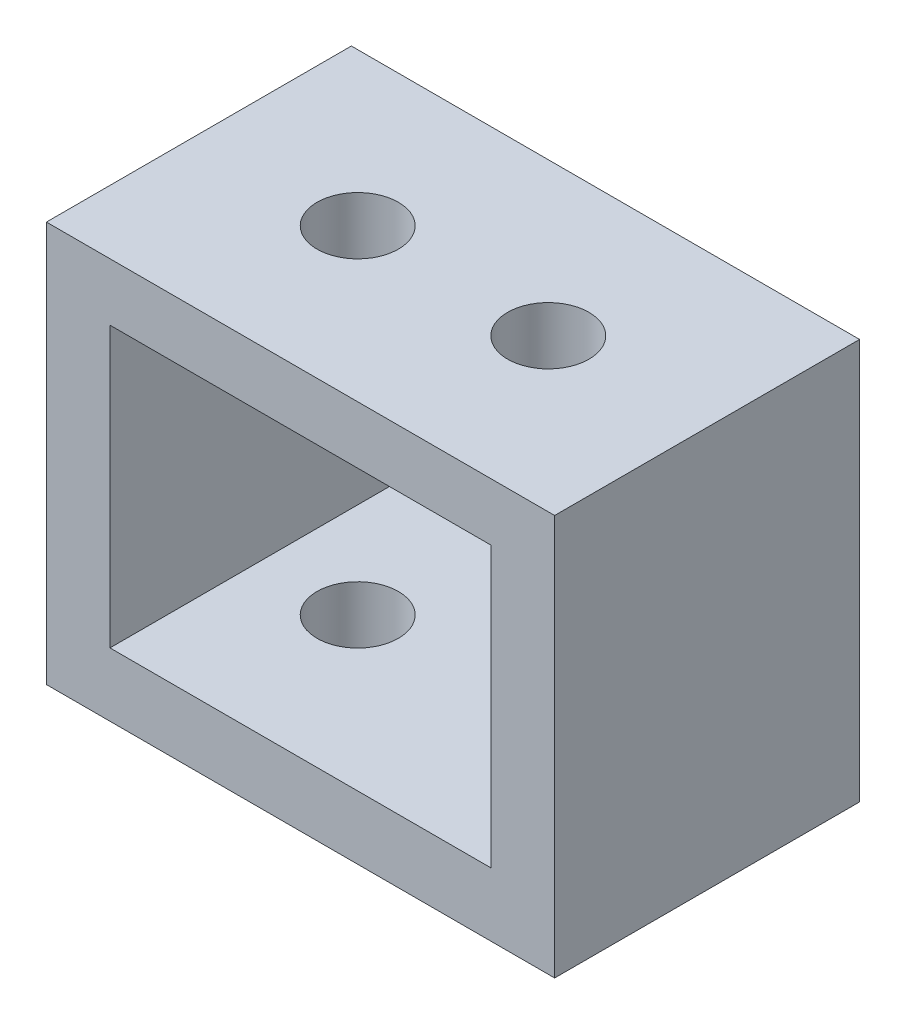
ISO-10303-21;
HEADER;
FILE_DESCRIPTION(('STEP AP214'),'2;1');
FILE_NAME('part.step','',(''),(''),'','','');
FILE_SCHEMA(('AUTOMOTIVE_DESIGN { 1 0 10303 214 1 1 1 1 }'));
ENDSEC;
DATA;
#1=APPLICATION_CONTEXT('core data for automotive mechanical design processes');
#2=APPLICATION_PROTOCOL_DEFINITION('international standard','automotive_design',2000,#1);
#3=PRODUCT_CONTEXT('',#1,'mechanical');
#4=PRODUCT('Part','Part','',(#3));
#5=PRODUCT_RELATED_PRODUCT_CATEGORY('part','',(#4));
#6=PRODUCT_DEFINITION_FORMATION('','',#4);
#7=PRODUCT_DEFINITION_CONTEXT('part definition',#1,'design');
#8=PRODUCT_DEFINITION('design','',#6,#7);
#9=PRODUCT_DEFINITION_SHAPE('','',#8);
#10=(LENGTH_UNIT() NAMED_UNIT(*) SI_UNIT(.MILLI.,.METRE.));
#11=(NAMED_UNIT(*) PLANE_ANGLE_UNIT() SI_UNIT($,.RADIAN.));
#12=(NAMED_UNIT(*) SI_UNIT($,.STERADIAN.) SOLID_ANGLE_UNIT());
#13=UNCERTAINTY_MEASURE_WITH_UNIT(LENGTH_MEASURE(1.E-05),#10,'distance_accuracy_value','');
#14=(GEOMETRIC_REPRESENTATION_CONTEXT(3) GLOBAL_UNCERTAINTY_ASSIGNED_CONTEXT((#13)) GLOBAL_UNIT_ASSIGNED_CONTEXT((#10,
#11,#12)) REPRESENTATION_CONTEXT('',''));
#15=CARTESIAN_POINT('',(0.,0.,0.));
#16=DIRECTION('',(0.,0.,1.));
#17=DIRECTION('',(1.,0.,0.));
#18=AXIS2_PLACEMENT_3D('',#15,#16,#17);
#19=CARTESIAN_POINT('',(0.,5.,-12.));
#20=DIRECTION('',(0.,0.,-1.));
#21=DIRECTION('',(-1.,0.,0.));
#22=AXIS2_PLACEMENT_3D('',#19,#20,#21);
#23=PLANE('',#22);
#24=DIRECTION('',(1.,0.,0.));
#25=VECTOR('',#24,1.);
#26=CARTESIAN_POINT('',(-20.,4.5268084003717,-12.));
#27=LINE('',#26,#25);
#28=CARTESIAN_POINT('',(-20.,4.52680840037171,-12.));
#29=VERTEX_POINT('',#28);
#30=CARTESIAN_POINT('',(20.,4.5268084003717,-12.));
#31=VERTEX_POINT('',#30);
#32=EDGE_CURVE('E55',#29,#31,#27,.T.);
#33=ORIENTED_EDGE('',*,*,#32,.T.);
#34=DIRECTION('',(0.,1.,0.));
#35=VECTOR('',#34,1.);
#36=CARTESIAN_POINT('',(20.,30.,-12.));
#37=LINE('',#36,#35);
#38=CARTESIAN_POINT('',(20.,-27.,-12.));
#39=VERTEX_POINT('',#38);
#40=EDGE_CURVE('E167',#39,#31,#37,.T.);
#41=ORIENTED_EDGE('',*,*,#40,.F.);
#42=DIRECTION('',(-1.,0.,0.));
#43=VECTOR('',#42,1.);
#44=CARTESIAN_POINT('',(20.,-27.,-12.));
#45=LINE('',#44,#43);
#46=CARTESIAN_POINT('',(-20.,-27.,-12.));
#47=VERTEX_POINT('',#46);
#48=EDGE_CURVE('E170',#39,#47,#45,.T.);
#49=ORIENTED_EDGE('',*,*,#48,.T.);
#50=DIRECTION('',(0.,1.,0.));
#51=VECTOR('',#50,1.);
#52=CARTESIAN_POINT('',(-20.,30.,-12.));
#53=LINE('',#52,#51);
#54=EDGE_CURVE('E127',#47,#29,#53,.T.);
#55=ORIENTED_EDGE('',*,*,#54,.T.);
#56=EDGE_LOOP('',(#33,#41,#49,#55));
#57=FACE_BOUND('',#56,.T.);
#58=DIRECTION('',(0.,1.,0.));
#59=VECTOR('',#58,1.);
#60=CARTESIAN_POINT('',(15.,30.,-12.));
#61=LINE('',#60,#59);
#62=CARTESIAN_POINT('',(15.,-22.,-12.));
#63=VERTEX_POINT('',#62);
#64=CARTESIAN_POINT('',(15.,0.,-12.));
#65=VERTEX_POINT('',#64);
#66=EDGE_CURVE('E165',#63,#65,#61,.T.);
#67=ORIENTED_EDGE('',*,*,#66,.T.);
#68=DIRECTION('',(1.,0.,0.));
#69=VECTOR('',#68,1.);
#70=CARTESIAN_POINT('',(0.,0.,-12.));
#71=LINE('',#70,#69);
#72=CARTESIAN_POINT('',(-15.,0.,-12.));
#73=VERTEX_POINT('',#72);
#74=EDGE_CURVE('E47',#73,#65,#71,.T.);
#75=ORIENTED_EDGE('',*,*,#74,.F.);
#76=DIRECTION('',(0.,1.,0.));
#77=VECTOR('',#76,1.);
#78=CARTESIAN_POINT('',(-15.,30.,-12.));
#79=LINE('',#78,#77);
#80=CARTESIAN_POINT('',(-15.,-22.,-12.));
#81=VERTEX_POINT('',#80);
#82=EDGE_CURVE('E125',#81,#73,#79,.T.);
#83=ORIENTED_EDGE('',*,*,#82,.F.);
#84=DIRECTION('',(-1.,0.,0.));
#85=VECTOR('',#84,1.);
#86=CARTESIAN_POINT('',(-15.,-22.,-12.));
#87=LINE('',#86,#85);
#88=EDGE_CURVE('E157',#63,#81,#87,.T.);
#89=ORIENTED_EDGE('',*,*,#88,.F.);
#90=EDGE_LOOP('',(#67,#75,#83,#89));
#91=FACE_BOUND('',#90,.T.);
#92=ADVANCED_FACE('F39',(#57,#91),#23,.T.);
#93=CARTESIAN_POINT('',(0.,5.,12.));
#94=DIRECTION('',(0.,0.,-1.));
#95=DIRECTION('',(-1.,0.,0.));
#96=AXIS2_PLACEMENT_3D('',#93,#94,#95);
#97=PLANE('',#96);
#98=DIRECTION('',(0.,-1.,0.));
#99=VECTOR('',#98,1.);
#100=CARTESIAN_POINT('',(-15.,30.,12.));
#101=LINE('',#100,#99);
#102=CARTESIAN_POINT('',(-15.,0.,12.));
#103=VERTEX_POINT('',#102);
#104=CARTESIAN_POINT('',(-15.,-22.,12.));
#105=VERTEX_POINT('',#104);
#106=EDGE_CURVE('E130',#103,#105,#101,.T.);
#107=ORIENTED_EDGE('',*,*,#106,.F.);
#108=DIRECTION('',(1.,0.,0.));
#109=VECTOR('',#108,1.);
#110=CARTESIAN_POINT('',(0.,0.,12.));
#111=LINE('',#110,#109);
#112=CARTESIAN_POINT('',(15.,0.,12.));
#113=VERTEX_POINT('',#112);
#114=EDGE_CURVE('E11',#103,#113,#111,.T.);
#115=ORIENTED_EDGE('',*,*,#114,.T.);
#116=DIRECTION('',(0.,-1.,0.));
#117=VECTOR('',#116,1.);
#118=CARTESIAN_POINT('',(15.,30.,12.));
#119=LINE('',#118,#117);
#120=CARTESIAN_POINT('',(15.,-22.,12.));
#121=VERTEX_POINT('',#120);
#122=EDGE_CURVE('E162',#113,#121,#119,.T.);
#123=ORIENTED_EDGE('',*,*,#122,.T.);
#124=DIRECTION('',(1.,0.,0.));
#125=VECTOR('',#124,1.);
#126=CARTESIAN_POINT('',(-15.,-22.,12.));
#127=LINE('',#126,#125);
#128=EDGE_CURVE('E160',#105,#121,#127,.T.);
#129=ORIENTED_EDGE('',*,*,#128,.F.);
#130=EDGE_LOOP('',(#107,#115,#123,#129));
#131=FACE_BOUND('',#130,.T.);
#132=DIRECTION('',(0.,-1.,0.));
#133=VECTOR('',#132,1.);
#134=CARTESIAN_POINT('',(20.,30.,12.));
#135=LINE('',#134,#133);
#136=CARTESIAN_POINT('',(20.,4.5268084003717,12.));
#137=VERTEX_POINT('',#136);
#138=CARTESIAN_POINT('',(20.,-27.,12.));
#139=VERTEX_POINT('',#138);
#140=EDGE_CURVE('E119',#137,#139,#135,.T.);
#141=ORIENTED_EDGE('',*,*,#140,.F.);
#142=DIRECTION('',(1.,0.,0.));
#143=VECTOR('',#142,1.);
#144=CARTESIAN_POINT('',(-20.,4.5268084003717,12.));
#145=LINE('',#144,#143);
#146=CARTESIAN_POINT('',(-20.,4.5268084003717,12.));
#147=VERTEX_POINT('',#146);
#148=EDGE_CURVE('E105',#147,#137,#145,.T.);
#149=ORIENTED_EDGE('',*,*,#148,.F.);
#150=DIRECTION('',(0.,-1.,0.));
#151=VECTOR('',#150,1.);
#152=CARTESIAN_POINT('',(-20.,30.,12.));
#153=LINE('',#152,#151);
#154=CARTESIAN_POINT('',(-20.,-27.,12.));
#155=VERTEX_POINT('',#154);
#156=EDGE_CURVE('E117',#147,#155,#153,.T.);
#157=ORIENTED_EDGE('',*,*,#156,.T.);
#158=DIRECTION('',(-1.,0.,0.));
#159=VECTOR('',#158,1.);
#160=CARTESIAN_POINT('',(20.,-27.,12.));
#161=LINE('',#160,#159);
#162=EDGE_CURVE('E174',#139,#155,#161,.T.);
#163=ORIENTED_EDGE('',*,*,#162,.F.);
#164=EDGE_LOOP('',(#141,#149,#157,#163));
#165=FACE_BOUND('',#164,.T.);
#166=ADVANCED_FACE('F115',(#131,#165),#97,.F.);
#167=CARTESIAN_POINT('',(0.,0.,0.));
#168=DIRECTION('',(0.,1.,0.));
#169=DIRECTION('',(0.,0.,1.));
#170=AXIS2_PLACEMENT_3D('',#167,#168,#169);
#171=PLANE('',#170);
#172=CARTESIAN_POINT('',(7.5,0.,0.));
#173=DIRECTION('',(0.,1.,0.));
#174=DIRECTION('',(0.,0.,1.));
#175=AXIS2_PLACEMENT_3D('',#172,#173,#174);
#176=CIRCLE('',#175,3.2);
#177=CARTESIAN_POINT('',(7.5,0.,-3.2));
#178=VERTEX_POINT('',#177);
#179=EDGE_CURVE('E144',#178,#178,#176,.T.);
#180=ORIENTED_EDGE('',*,*,#179,.T.);
#181=EDGE_LOOP('',(#180));
#182=FACE_BOUND('',#181,.T.);
#183=CARTESIAN_POINT('',(-7.5,0.,0.));
#184=DIRECTION('',(0.,1.,0.));
#185=DIRECTION('',(0.,0.,1.));
#186=AXIS2_PLACEMENT_3D('',#183,#184,#185);
#187=CIRCLE('',#186,3.2);
#188=CARTESIAN_POINT('',(-7.5,0.,-3.2));
#189=VERTEX_POINT('',#188);
#190=EDGE_CURVE('E151',#189,#189,#187,.T.);
#191=ORIENTED_EDGE('',*,*,#190,.T.);
#192=EDGE_LOOP('',(#191));
#193=FACE_BOUND('',#192,.T.);
#194=DIRECTION('',(0.,0.,1.));
#195=VECTOR('',#194,1.);
#196=CARTESIAN_POINT('',(15.,0.,0.));
#197=LINE('',#196,#195);
#198=EDGE_CURVE('E176',#65,#113,#197,.T.);
#199=ORIENTED_EDGE('',*,*,#198,.T.);
#200=ORIENTED_EDGE('',*,*,#114,.F.);
#201=DIRECTION('',(0.,0.,1.));
#202=VECTOR('',#201,1.);
#203=CARTESIAN_POINT('',(-15.,0.,0.));
#204=LINE('',#203,#202);
#205=EDGE_CURVE('E137',#73,#103,#204,.T.);
#206=ORIENTED_EDGE('',*,*,#205,.F.);
#207=ORIENTED_EDGE('',*,*,#74,.T.);
#208=EDGE_LOOP('',(#199,#200,#206,#207));
#209=FACE_BOUND('',#208,.T.);
#210=ADVANCED_FACE('F202',(#182,#193,#209),#171,.F.);
#211=CARTESIAN_POINT('',(20.,-27.,12.));
#212=DIRECTION('',(0.,1.,0.));
#213=DIRECTION('',(0.,0.,1.));
#214=AXIS2_PLACEMENT_3D('',#211,#212,#213);
#215=PLANE('',#214);
#216=CARTESIAN_POINT('',(7.5,-27.,0.));
#217=DIRECTION('',(0.,-1.,0.));
#218=DIRECTION('',(0.,0.,-1.));
#219=AXIS2_PLACEMENT_3D('',#216,#217,#218);
#220=CIRCLE('',#219,3.2);
#221=CARTESIAN_POINT('',(7.5,-27.,-3.2));
#222=VERTEX_POINT('',#221);
#223=EDGE_CURVE('E141',#222,#222,#220,.T.);
#224=ORIENTED_EDGE('',*,*,#223,.F.);
#225=EDGE_LOOP('',(#224));
#226=FACE_BOUND('',#225,.T.);
#227=CARTESIAN_POINT('',(-7.5,-27.,0.));
#228=DIRECTION('',(0.,-1.,0.));
#229=DIRECTION('',(0.,0.,-1.));
#230=AXIS2_PLACEMENT_3D('',#227,#228,#229);
#231=CIRCLE('',#230,3.2);
#232=CARTESIAN_POINT('',(-7.5,-27.,-3.2));
#233=VERTEX_POINT('',#232);
#234=EDGE_CURVE('E147',#233,#233,#231,.T.);
#235=ORIENTED_EDGE('',*,*,#234,.F.);
#236=EDGE_LOOP('',(#235));
#237=FACE_BOUND('',#236,.T.);
#238=DIRECTION('',(0.,0.,-1.));
#239=VECTOR('',#238,1.);
#240=CARTESIAN_POINT('',(-20.,-27.,12.));
#241=LINE('',#240,#239);
#242=EDGE_CURVE('E124',#155,#47,#241,.T.);
#243=ORIENTED_EDGE('',*,*,#242,.T.);
#244=ORIENTED_EDGE('',*,*,#48,.F.);
#245=DIRECTION('',(0.,0.,-1.));
#246=VECTOR('',#245,1.);
#247=CARTESIAN_POINT('',(20.,-27.,12.));
#248=LINE('',#247,#246);
#249=EDGE_CURVE('E164',#139,#39,#248,.T.);
#250=ORIENTED_EDGE('',*,*,#249,.F.);
#251=ORIENTED_EDGE('',*,*,#162,.T.);
#252=EDGE_LOOP('',(#243,#244,#250,#251));
#253=FACE_BOUND('',#252,.T.);
#254=ADVANCED_FACE('F211',(#226,#237,#253),#215,.F.);
#255=CARTESIAN_POINT('',(20.,0.,0.));
#256=DIRECTION('',(1.,0.,0.));
#257=DIRECTION('',(0.,0.,-1.));
#258=AXIS2_PLACEMENT_3D('',#255,#256,#257);
#259=PLANE('',#258);
#260=DIRECTION('',(0.,0.,1.));
#261=VECTOR('',#260,1.);
#262=CARTESIAN_POINT('',(20.,4.5268084003717,-12.));
#263=LINE('',#262,#261);
#264=EDGE_CURVE('E111',#31,#137,#263,.T.);
#265=ORIENTED_EDGE('',*,*,#264,.T.);
#266=ORIENTED_EDGE('',*,*,#140,.T.);
#267=ORIENTED_EDGE('',*,*,#249,.T.);
#268=ORIENTED_EDGE('',*,*,#40,.T.);
#269=EDGE_LOOP('',(#265,#266,#267,#268));
#270=FACE_BOUND('',#269,.T.);
#271=ADVANCED_FACE('F218',(#270),#259,.T.);
#272=CARTESIAN_POINT('',(15.,0.,0.));
#273=DIRECTION('',(1.,0.,0.));
#274=DIRECTION('',(0.,0.,-1.));
#275=AXIS2_PLACEMENT_3D('',#272,#273,#274);
#276=PLANE('',#275);
#277=ORIENTED_EDGE('',*,*,#66,.F.);
#278=DIRECTION('',(0.,0.,-1.));
#279=VECTOR('',#278,1.);
#280=CARTESIAN_POINT('',(15.,-22.,-12.));
#281=LINE('',#280,#279);
#282=EDGE_CURVE('E154',#121,#63,#281,.T.);
#283=ORIENTED_EDGE('',*,*,#282,.F.);
#284=ORIENTED_EDGE('',*,*,#122,.F.);
#285=ORIENTED_EDGE('',*,*,#198,.F.);
#286=EDGE_LOOP('',(#277,#283,#284,#285));
#287=FACE_BOUND('',#286,.T.);
#288=ADVANCED_FACE('F188',(#287),#276,.F.);
#289=CARTESIAN_POINT('',(0.,-22.,0.));
#290=DIRECTION('',(0.,1.,0.));
#291=DIRECTION('',(0.,0.,1.));
#292=AXIS2_PLACEMENT_3D('',#289,#290,#291);
#293=PLANE('',#292);
#294=CARTESIAN_POINT('',(7.5,-22.,0.));
#295=DIRECTION('',(0.,1.,0.));
#296=DIRECTION('',(0.,0.,1.));
#297=AXIS2_PLACEMENT_3D('',#294,#295,#296);
#298=CIRCLE('',#297,3.2);
#299=CARTESIAN_POINT('',(7.5,-22.,-3.2));
#300=VERTEX_POINT('',#299);
#301=EDGE_CURVE('E42',#300,#300,#298,.T.);
#302=ORIENTED_EDGE('',*,*,#301,.F.);
#303=EDGE_LOOP('',(#302));
#304=FACE_BOUND('',#303,.T.);
#305=CARTESIAN_POINT('',(-7.5,-22.,0.));
#306=DIRECTION('',(0.,1.,0.));
#307=DIRECTION('',(0.,0.,1.));
#308=AXIS2_PLACEMENT_3D('',#305,#306,#307);
#309=CIRCLE('',#308,3.2);
#310=CARTESIAN_POINT('',(-7.5,-22.,-3.2));
#311=VERTEX_POINT('',#310);
#312=EDGE_CURVE('E150',#311,#311,#309,.T.);
#313=ORIENTED_EDGE('',*,*,#312,.F.);
#314=EDGE_LOOP('',(#313));
#315=FACE_BOUND('',#314,.T.);
#316=ORIENTED_EDGE('',*,*,#282,.T.);
#317=ORIENTED_EDGE('',*,*,#88,.T.);
#318=DIRECTION('',(0.,0.,-1.));
#319=VECTOR('',#318,1.);
#320=CARTESIAN_POINT('',(-15.,-22.,-12.));
#321=LINE('',#320,#319);
#322=EDGE_CURVE('E133',#105,#81,#321,.T.);
#323=ORIENTED_EDGE('',*,*,#322,.F.);
#324=ORIENTED_EDGE('',*,*,#128,.T.);
#325=EDGE_LOOP('',(#316,#317,#323,#324));
#326=FACE_BOUND('',#325,.T.);
#327=ADVANCED_FACE('F185',(#304,#315,#326),#293,.T.);
#328=CARTESIAN_POINT('',(-7.5,30.,0.));
#329=DIRECTION('',(0.,-1.,0.));
#330=DIRECTION('',(0.,0.,-1.));
#331=AXIS2_PLACEMENT_3D('',#328,#329,#330);
#332=CYLINDRICAL_SURFACE('',#331,3.2);
#333=CARTESIAN_POINT('',(-7.5,-22.,-3.2));
#334=CARTESIAN_POINT('',(-7.5,-22.0520833333333,-3.2));
#335=CARTESIAN_POINT('',(-7.5,-22.1041666666667,-3.2));
#336=CARTESIAN_POINT('',(-7.5,-22.2083333333333,-3.2));
#337=CARTESIAN_POINT('',(-7.5,-22.2604166666667,-3.2));
#338=CARTESIAN_POINT('',(-7.5,-22.3645833333333,-3.2));
#339=CARTESIAN_POINT('',(-7.5,-22.4166666666667,-3.2));
#340=CARTESIAN_POINT('',(-7.5,-22.5208333333333,-3.2));
#341=CARTESIAN_POINT('',(-7.5,-22.5729166666667,-3.2));
#342=CARTESIAN_POINT('',(-7.5,-22.6770833333333,-3.2));
#343=CARTESIAN_POINT('',(-7.5,-22.7291666666667,-3.2));
#344=CARTESIAN_POINT('',(-7.5,-22.8333333333333,-3.2));
#345=CARTESIAN_POINT('',(-7.5,-22.8854166666667,-3.2));
#346=CARTESIAN_POINT('',(-7.5,-22.9895833333333,-3.2));
#347=CARTESIAN_POINT('',(-7.5,-23.0416666666667,-3.2));
#348=CARTESIAN_POINT('',(-7.5,-23.1458333333333,-3.2));
#349=CARTESIAN_POINT('',(-7.5,-23.1979166666667,-3.2));
#350=CARTESIAN_POINT('',(-7.5,-23.3020833333333,-3.2));
#351=CARTESIAN_POINT('',(-7.5,-23.3541666666667,-3.2));
#352=CARTESIAN_POINT('',(-7.5,-23.4583333333333,-3.2));
#353=CARTESIAN_POINT('',(-7.5,-23.5104166666667,-3.2));
#354=CARTESIAN_POINT('',(-7.5,-23.6145833333333,-3.2));
#355=CARTESIAN_POINT('',(-7.5,-23.6666666666667,-3.2));
#356=CARTESIAN_POINT('',(-7.5,-23.7708333333333,-3.2));
#357=CARTESIAN_POINT('',(-7.5,-23.8229166666667,-3.2));
#358=CARTESIAN_POINT('',(-7.5,-23.9270833333333,-3.2));
#359=CARTESIAN_POINT('',(-7.5,-23.9791666666667,-3.2));
#360=CARTESIAN_POINT('',(-7.5,-24.0833333333333,-3.2));
#361=CARTESIAN_POINT('',(-7.5,-24.1354166666667,-3.2));
#362=CARTESIAN_POINT('',(-7.5,-24.2395833333333,-3.2));
#363=CARTESIAN_POINT('',(-7.5,-24.2916666666667,-3.2));
#364=CARTESIAN_POINT('',(-7.5,-24.3958333333333,-3.2));
#365=CARTESIAN_POINT('',(-7.5,-24.4479166666667,-3.2));
#366=CARTESIAN_POINT('',(-7.5,-24.5520833333333,-3.2));
#367=CARTESIAN_POINT('',(-7.5,-24.6041666666667,-3.2));
#368=CARTESIAN_POINT('',(-7.5,-24.7083333333333,-3.2));
#369=CARTESIAN_POINT('',(-7.5,-24.7604166666667,-3.2));
#370=CARTESIAN_POINT('',(-7.5,-24.8645833333333,-3.2));
#371=CARTESIAN_POINT('',(-7.5,-24.9166666666667,-3.2));
#372=CARTESIAN_POINT('',(-7.5,-25.0208333333333,-3.2));
#373=CARTESIAN_POINT('',(-7.5,-25.0729166666667,-3.2));
#374=CARTESIAN_POINT('',(-7.5,-25.1770833333333,-3.2));
#375=CARTESIAN_POINT('',(-7.5,-25.2291666666667,-3.2));
#376=CARTESIAN_POINT('',(-7.5,-25.3333333333333,-3.2));
#377=CARTESIAN_POINT('',(-7.5,-25.3854166666667,-3.2));
#378=CARTESIAN_POINT('',(-7.5,-25.4895833333333,-3.2));
#379=CARTESIAN_POINT('',(-7.5,-25.5416666666667,-3.2));
#380=CARTESIAN_POINT('',(-7.5,-25.6458333333333,-3.2));
#381=CARTESIAN_POINT('',(-7.5,-25.6979166666667,-3.2));
#382=CARTESIAN_POINT('',(-7.5,-25.8020833333333,-3.2));
#383=CARTESIAN_POINT('',(-7.5,-25.8541666666667,-3.2));
#384=CARTESIAN_POINT('',(-7.5,-25.9583333333333,-3.2));
#385=CARTESIAN_POINT('',(-7.5,-26.0104166666667,-3.2));
#386=CARTESIAN_POINT('',(-7.5,-26.1145833333333,-3.2));
#387=CARTESIAN_POINT('',(-7.5,-26.1666666666667,-3.2));
#388=CARTESIAN_POINT('',(-7.5,-26.2708333333333,-3.2));
#389=CARTESIAN_POINT('',(-7.5,-26.3229166666667,-3.2));
#390=CARTESIAN_POINT('',(-7.5,-26.4270833333333,-3.2));
#391=CARTESIAN_POINT('',(-7.5,-26.4791666666667,-3.2));
#392=CARTESIAN_POINT('',(-7.5,-26.5833333333333,-3.2));
#393=CARTESIAN_POINT('',(-7.5,-26.6354166666667,-3.2));
#394=CARTESIAN_POINT('',(-7.5,-26.7395833333333,-3.2));
#395=CARTESIAN_POINT('',(-7.5,-26.7916666666667,-3.2));
#396=CARTESIAN_POINT('',(-7.5,-26.8958333333333,-3.2));
#397=CARTESIAN_POINT('',(-7.5,-26.9479166666667,-3.2));
#398=CARTESIAN_POINT('',(-7.5,-27.,-3.2));
#399=B_SPLINE_CURVE_WITH_KNOTS('',3,(#333,#334,#335,#336,#337,#338,#339,#340,#341,#342,#343,
#344,#345,#346,#347,#348,#349,#350,#351,#352,#353,#354,#355,#356,#357,#358,#359,#360,#361,#362,
#363,#364,#365,#366,#367,#368,#369,#370,#371,#372,#373,#374,#375,#376,#377,#378,#379,#380,#381,
#382,#383,#384,#385,#386,#387,#388,#389,#390,#391,#392,#393,#394,#395,#396,#397,#398),
.UNSPECIFIED.,.F.,.F.,(4,2,2,2,2,2,2,2,2,2,2,2,2,2,2,2,2,2,2,2,2,2,2,2,2,2,2,2,2,2,2,2,4),(0.,
0.156249999999997,0.3125,0.468749999999997,0.625000000000001,0.781249999999997,
0.937500000000001,1.09375,1.25,1.40625,1.56249999999999,1.71875,1.87499999999999,2.03125,2.1875,
2.34375,2.5,2.65624999999999,2.8125,2.96874999999999,3.125,3.28124999999999,3.4375,
3.59374999999999,3.74999999999999,3.90624999999999,4.06249999999999,4.21874999999999,
4.37499999999999,4.53124999999999,4.68749999999999,4.84374999999999,4.99999999999999),.UNSPECIFIED.);
#400=EDGE_CURVE('BSEAM182',#311,#233,#399,.T.);
#401=ORIENTED_EDGE('',*,*,#312,.T.);
#402=ORIENTED_EDGE('',*,*,#234,.T.);
#403=ORIENTED_EDGE('',*,*,#400,.T.);
#404=ORIENTED_EDGE('',*,*,#400,.F.);
#405=EDGE_LOOP('',(#401,#403,#402,#404));
#406=FACE_BOUND('',#405,.T.);
#407=ADVANCED_FACE('F182',(#406),#332,.F.);
#408=CARTESIAN_POINT('',(-7.5,4.5268084003717,0.));
#409=DIRECTION('',(0.,-1.,0.));
#410=DIRECTION('',(0.,0.,-1.));
#411=AXIS2_PLACEMENT_3D('',#408,#409,#410);
#412=CIRCLE('',#411,3.2);
#413=CARTESIAN_POINT('',(-7.5,4.5268084003717,-3.2));
#414=VERTEX_POINT('',#413);
#415=EDGE_CURVE('E244',#414,#414,#412,.F.);
#416=CARTESIAN_POINT('',(-7.5,4.5268084003717,-3.2));
#417=CARTESIAN_POINT('',(-7.5,4.47965414620116,-3.2));
#418=CARTESIAN_POINT('',(-7.5,4.43249989203063,-3.2));
#419=CARTESIAN_POINT('',(-7.5,4.33819138368955,-3.2));
#420=CARTESIAN_POINT('',(-7.5,4.29103712951901,-3.2));
#421=CARTESIAN_POINT('',(-7.5,4.19672862117793,-3.2));
#422=CARTESIAN_POINT('',(-7.5,4.14957436700739,-3.2));
#423=CARTESIAN_POINT('',(-7.5,4.05526585866632,-3.2));
#424=CARTESIAN_POINT('',(-7.5,4.00811160449578,-3.2));
#425=CARTESIAN_POINT('',(-7.5,3.9138030961547,-3.2));
#426=CARTESIAN_POINT('',(-7.5,3.86664884198416,-3.2));
#427=CARTESIAN_POINT('',(-7.5,3.77234033364308,-3.2));
#428=CARTESIAN_POINT('',(-7.5,3.72518607947254,-3.2));
#429=CARTESIAN_POINT('',(-7.5,3.63087757113147,-3.2));
#430=CARTESIAN_POINT('',(-7.5,3.58372331696093,-3.2));
#431=CARTESIAN_POINT('',(-7.5,3.48941480861985,-3.2));
#432=CARTESIAN_POINT('',(-7.5,3.44226055444931,-3.2));
#433=CARTESIAN_POINT('',(-7.5,3.34795204610824,-3.2));
#434=CARTESIAN_POINT('',(-7.5,3.3007977919377,-3.2));
#435=CARTESIAN_POINT('',(-7.5,3.20648928359662,-3.2));
#436=CARTESIAN_POINT('',(-7.5,3.15933502942608,-3.2));
#437=CARTESIAN_POINT('',(-7.5,3.06502652108501,-3.2));
#438=CARTESIAN_POINT('',(-7.5,3.01787226691447,-3.2));
#439=CARTESIAN_POINT('',(-7.5,2.92356375857339,-3.2));
#440=CARTESIAN_POINT('',(-7.5,2.87640950440285,-3.2));
#441=CARTESIAN_POINT('',(-7.5,2.78210099606178,-3.2));
#442=CARTESIAN_POINT('',(-7.5,2.73494674189124,-3.2));
#443=CARTESIAN_POINT('',(-7.5,2.64063823355016,-3.2));
#444=CARTESIAN_POINT('',(-7.5,2.59348397937962,-3.2));
#445=CARTESIAN_POINT('',(-7.5,2.49917547103854,-3.2));
#446=CARTESIAN_POINT('',(-7.5,2.452021216868,-3.2));
#447=CARTESIAN_POINT('',(-7.5,2.35771270852693,-3.2));
#448=CARTESIAN_POINT('',(-7.5,2.31055845435639,-3.2));
#449=CARTESIAN_POINT('',(-7.5,2.21624994601531,-3.2));
#450=CARTESIAN_POINT('',(-7.5,2.16909569184477,-3.2));
#451=CARTESIAN_POINT('',(-7.5,2.0747871835037,-3.2));
#452=CARTESIAN_POINT('',(-7.5,2.02763292933316,-3.2));
#453=CARTESIAN_POINT('',(-7.5,1.93332442099208,-3.2));
#454=CARTESIAN_POINT('',(-7.5,1.88617016682154,-3.2));
#455=CARTESIAN_POINT('',(-7.5,1.79186165848046,-3.2));
#456=CARTESIAN_POINT('',(-7.5,1.74470740430993,-3.2));
#457=CARTESIAN_POINT('',(-7.5,1.65039889596885,-3.2));
#458=CARTESIAN_POINT('',(-7.5,1.60324464179831,-3.2));
#459=CARTESIAN_POINT('',(-7.5,1.50893613345723,-3.2));
#460=CARTESIAN_POINT('',(-7.5,1.46178187928669,-3.2));
#461=CARTESIAN_POINT('',(-7.5,1.36747337094562,-3.2));
#462=CARTESIAN_POINT('',(-7.5,1.32031911677508,-3.2));
#463=CARTESIAN_POINT('',(-7.5,1.226010608434,-3.2));
#464=CARTESIAN_POINT('',(-7.5,1.17885635426346,-3.2));
#465=CARTESIAN_POINT('',(-7.5,1.08454784592239,-3.2));
#466=CARTESIAN_POINT('',(-7.5,1.03739359175185,-3.2));
#467=CARTESIAN_POINT('',(-7.5,0.943085083410772,-3.2));
#468=CARTESIAN_POINT('',(-7.5,0.895930829240234,-3.2));
#469=CARTESIAN_POINT('',(-7.5,0.801622320899156,-3.2));
#470=CARTESIAN_POINT('',(-7.5,0.754468066728617,-3.2));
#471=CARTESIAN_POINT('',(-7.5,0.660159558387539,-3.2));
#472=CARTESIAN_POINT('',(-7.5,0.613005304217001,-3.2));
#473=CARTESIAN_POINT('',(-7.5,0.518696795875924,-3.2));
#474=CARTESIAN_POINT('',(-7.5,0.471542541705386,-3.2));
#475=CARTESIAN_POINT('',(-7.5,0.377234033364308,-3.2));
#476=CARTESIAN_POINT('',(-7.5,0.330079779193769,-3.2));
#477=CARTESIAN_POINT('',(-7.5,0.235771270852691,-3.2));
#478=CARTESIAN_POINT('',(-7.5,0.188617016682153,-3.2));
#479=CARTESIAN_POINT('',(-7.5,0.0943085083410765,-3.2));
#480=CARTESIAN_POINT('',(-7.5,0.0471542541705383,-3.2));
#481=CARTESIAN_POINT('',(-7.5,0.,-3.2));
#482=B_SPLINE_CURVE_WITH_KNOTS('',3,(#416,#417,#418,#419,#420,#421,#422,#423,#424,#425,#426,
#427,#428,#429,#430,#431,#432,#433,#434,#435,#436,#437,#438,#439,#440,#441,#442,#443,#444,#445,
#446,#447,#448,#449,#450,#451,#452,#453,#454,#455,#456,#457,#458,#459,#460,#461,#462,#463,#464,
#465,#466,#467,#468,#469,#470,#471,#472,#473,#474,#475,#476,#477,#478,#479,#480,#481),
.UNSPECIFIED.,.F.,.F.,(4,2,2,2,2,2,2,2,2,2,2,2,2,2,2,2,2,2,2,2,2,2,2,2,2,2,2,2,2,2,2,2,4),(0.,
0.141462762511615,0.28292552502323,0.424388287534848,0.565851050046463,0.707313812558077,
0.848776575069696,0.990239337581311,1.13170210009293,1.27316486260454,1.41462762511615,
1.55609038762777,1.69755315013939,1.839015912651,1.98047867516262,2.12194143767424,
2.26340420018585,2.40486696269747,2.54632972520908,2.6877924877207,2.82925525023231,
2.97071801274393,3.11218077525555,3.25364353776716,3.39510630027878,3.53656906279039,
3.67803182530201,3.81949458781362,3.96095735032524,4.10242011283685,4.24388287534847,
4.38534563786009,4.5268084003717),.UNSPECIFIED.);
#483=EDGE_CURVE('BSEAM226',#414,#189,#482,.T.);
#484=ORIENTED_EDGE('',*,*,#415,.T.);
#485=ORIENTED_EDGE('',*,*,#190,.F.);
#486=ORIENTED_EDGE('',*,*,#483,.T.);
#487=ORIENTED_EDGE('',*,*,#483,.F.);
#488=EDGE_LOOP('',(#484,#486,#485,#487));
#489=FACE_BOUND('',#488,.T.);
#490=ADVANCED_FACE('F226',(#489),#332,.F.);
#491=CARTESIAN_POINT('',(7.5,30.,0.));
#492=DIRECTION('',(0.,-1.,0.));
#493=DIRECTION('',(0.,0.,-1.));
#494=AXIS2_PLACEMENT_3D('',#491,#492,#493);
#495=CYLINDRICAL_SURFACE('',#494,3.2);
#496=CARTESIAN_POINT('',(7.5,-22.,-3.2));
#497=CARTESIAN_POINT('',(7.5,-22.0520833333333,-3.2));
#498=CARTESIAN_POINT('',(7.5,-22.1041666666667,-3.2));
#499=CARTESIAN_POINT('',(7.5,-22.2083333333333,-3.2));
#500=CARTESIAN_POINT('',(7.5,-22.2604166666667,-3.2));
#501=CARTESIAN_POINT('',(7.5,-22.3645833333333,-3.2));
#502=CARTESIAN_POINT('',(7.5,-22.4166666666667,-3.2));
#503=CARTESIAN_POINT('',(7.5,-22.5208333333333,-3.2));
#504=CARTESIAN_POINT('',(7.5,-22.5729166666667,-3.2));
#505=CARTESIAN_POINT('',(7.5,-22.6770833333333,-3.2));
#506=CARTESIAN_POINT('',(7.5,-22.7291666666667,-3.2));
#507=CARTESIAN_POINT('',(7.5,-22.8333333333333,-3.2));
#508=CARTESIAN_POINT('',(7.5,-22.8854166666667,-3.2));
#509=CARTESIAN_POINT('',(7.5,-22.9895833333333,-3.2));
#510=CARTESIAN_POINT('',(7.5,-23.0416666666667,-3.2));
#511=CARTESIAN_POINT('',(7.5,-23.1458333333333,-3.2));
#512=CARTESIAN_POINT('',(7.5,-23.1979166666667,-3.2));
#513=CARTESIAN_POINT('',(7.5,-23.3020833333333,-3.2));
#514=CARTESIAN_POINT('',(7.5,-23.3541666666667,-3.2));
#515=CARTESIAN_POINT('',(7.5,-23.4583333333333,-3.2));
#516=CARTESIAN_POINT('',(7.5,-23.5104166666667,-3.2));
#517=CARTESIAN_POINT('',(7.5,-23.6145833333333,-3.2));
#518=CARTESIAN_POINT('',(7.5,-23.6666666666667,-3.2));
#519=CARTESIAN_POINT('',(7.5,-23.7708333333333,-3.2));
#520=CARTESIAN_POINT('',(7.5,-23.8229166666667,-3.2));
#521=CARTESIAN_POINT('',(7.5,-23.9270833333333,-3.2));
#522=CARTESIAN_POINT('',(7.5,-23.9791666666667,-3.2));
#523=CARTESIAN_POINT('',(7.5,-24.0833333333333,-3.2));
#524=CARTESIAN_POINT('',(7.5,-24.1354166666667,-3.2));
#525=CARTESIAN_POINT('',(7.5,-24.2395833333333,-3.2));
#526=CARTESIAN_POINT('',(7.5,-24.2916666666667,-3.2));
#527=CARTESIAN_POINT('',(7.5,-24.3958333333333,-3.2));
#528=CARTESIAN_POINT('',(7.5,-24.4479166666667,-3.2));
#529=CARTESIAN_POINT('',(7.5,-24.5520833333333,-3.2));
#530=CARTESIAN_POINT('',(7.5,-24.6041666666667,-3.2));
#531=CARTESIAN_POINT('',(7.5,-24.7083333333333,-3.2));
#532=CARTESIAN_POINT('',(7.5,-24.7604166666667,-3.2));
#533=CARTESIAN_POINT('',(7.5,-24.8645833333333,-3.2));
#534=CARTESIAN_POINT('',(7.5,-24.9166666666667,-3.2));
#535=CARTESIAN_POINT('',(7.5,-25.0208333333333,-3.2));
#536=CARTESIAN_POINT('',(7.5,-25.0729166666667,-3.2));
#537=CARTESIAN_POINT('',(7.5,-25.1770833333333,-3.2));
#538=CARTESIAN_POINT('',(7.5,-25.2291666666667,-3.2));
#539=CARTESIAN_POINT('',(7.5,-25.3333333333333,-3.2));
#540=CARTESIAN_POINT('',(7.5,-25.3854166666667,-3.2));
#541=CARTESIAN_POINT('',(7.5,-25.4895833333333,-3.2));
#542=CARTESIAN_POINT('',(7.5,-25.5416666666667,-3.2));
#543=CARTESIAN_POINT('',(7.5,-25.6458333333333,-3.2));
#544=CARTESIAN_POINT('',(7.5,-25.6979166666667,-3.2));
#545=CARTESIAN_POINT('',(7.5,-25.8020833333333,-3.2));
#546=CARTESIAN_POINT('',(7.5,-25.8541666666667,-3.2));
#547=CARTESIAN_POINT('',(7.5,-25.9583333333333,-3.2));
#548=CARTESIAN_POINT('',(7.5,-26.0104166666667,-3.2));
#549=CARTESIAN_POINT('',(7.5,-26.1145833333333,-3.2));
#550=CARTESIAN_POINT('',(7.5,-26.1666666666667,-3.2));
#551=CARTESIAN_POINT('',(7.5,-26.2708333333333,-3.2));
#552=CARTESIAN_POINT('',(7.5,-26.3229166666667,-3.2));
#553=CARTESIAN_POINT('',(7.5,-26.4270833333333,-3.2));
#554=CARTESIAN_POINT('',(7.5,-26.4791666666667,-3.2));
#555=CARTESIAN_POINT('',(7.5,-26.5833333333333,-3.2));
#556=CARTESIAN_POINT('',(7.5,-26.6354166666667,-3.2));
#557=CARTESIAN_POINT('',(7.5,-26.7395833333333,-3.2));
#558=CARTESIAN_POINT('',(7.5,-26.7916666666667,-3.2));
#559=CARTESIAN_POINT('',(7.5,-26.8958333333333,-3.2));
#560=CARTESIAN_POINT('',(7.5,-26.9479166666667,-3.2));
#561=CARTESIAN_POINT('',(7.5,-27.,-3.2));
#562=B_SPLINE_CURVE_WITH_KNOTS('',3,(#496,#497,#498,#499,#500,#501,#502,#503,#504,#505,#506,
#507,#508,#509,#510,#511,#512,#513,#514,#515,#516,#517,#518,#519,#520,#521,#522,#523,#524,#525,
#526,#527,#528,#529,#530,#531,#532,#533,#534,#535,#536,#537,#538,#539,#540,#541,#542,#543,#544,
#545,#546,#547,#548,#549,#550,#551,#552,#553,#554,#555,#556,#557,#558,#559,#560,#561),
.UNSPECIFIED.,.F.,.F.,(4,2,2,2,2,2,2,2,2,2,2,2,2,2,2,2,2,2,2,2,2,2,2,2,2,2,2,2,2,2,2,2,4),(0.,
0.156249999999997,0.3125,0.468749999999997,0.625000000000001,0.781249999999997,
0.937500000000001,1.09375,1.25,1.40625,1.56249999999999,1.71875,1.87499999999999,2.03125,2.1875,
2.34375,2.5,2.65624999999999,2.8125,2.96874999999999,3.125,3.28124999999999,3.4375,
3.59374999999999,3.74999999999999,3.90624999999999,4.06249999999999,4.21874999999999,
4.37499999999999,4.53124999999999,4.68749999999999,4.84374999999999,4.99999999999999),.UNSPECIFIED.);
#563=EDGE_CURVE('BSEAM227',#300,#222,#562,.T.);
#564=ORIENTED_EDGE('',*,*,#301,.T.);
#565=ORIENTED_EDGE('',*,*,#223,.T.);
#566=ORIENTED_EDGE('',*,*,#563,.T.);
#567=ORIENTED_EDGE('',*,*,#563,.F.);
#568=EDGE_LOOP('',(#564,#566,#565,#567));
#569=FACE_BOUND('',#568,.T.);
#570=ADVANCED_FACE('F227',(#569),#495,.F.);
#571=CARTESIAN_POINT('',(7.5,4.5268084003717,0.));
#572=DIRECTION('',(0.,-1.,0.));
#573=DIRECTION('',(0.,0.,-1.));
#574=AXIS2_PLACEMENT_3D('',#571,#572,#573);
#575=CIRCLE('',#574,3.2);
#576=CARTESIAN_POINT('',(7.5,4.5268084003717,-3.2));
#577=VERTEX_POINT('',#576);
#578=EDGE_CURVE('E242',#577,#577,#575,.F.);
#579=CARTESIAN_POINT('',(7.5,4.5268084003717,-3.2));
#580=CARTESIAN_POINT('',(7.5,4.47965414620116,-3.2));
#581=CARTESIAN_POINT('',(7.5,4.43249989203063,-3.2));
#582=CARTESIAN_POINT('',(7.5,4.33819138368955,-3.2));
#583=CARTESIAN_POINT('',(7.5,4.29103712951901,-3.2));
#584=CARTESIAN_POINT('',(7.5,4.19672862117793,-3.2));
#585=CARTESIAN_POINT('',(7.5,4.14957436700739,-3.2));
#586=CARTESIAN_POINT('',(7.5,4.05526585866632,-3.2));
#587=CARTESIAN_POINT('',(7.5,4.00811160449578,-3.2));
#588=CARTESIAN_POINT('',(7.5,3.9138030961547,-3.2));
#589=CARTESIAN_POINT('',(7.5,3.86664884198416,-3.2));
#590=CARTESIAN_POINT('',(7.5,3.77234033364308,-3.2));
#591=CARTESIAN_POINT('',(7.5,3.72518607947254,-3.2));
#592=CARTESIAN_POINT('',(7.5,3.63087757113147,-3.2));
#593=CARTESIAN_POINT('',(7.5,3.58372331696093,-3.2));
#594=CARTESIAN_POINT('',(7.5,3.48941480861985,-3.2));
#595=CARTESIAN_POINT('',(7.5,3.44226055444931,-3.2));
#596=CARTESIAN_POINT('',(7.5,3.34795204610824,-3.2));
#597=CARTESIAN_POINT('',(7.5,3.3007977919377,-3.2));
#598=CARTESIAN_POINT('',(7.5,3.20648928359662,-3.2));
#599=CARTESIAN_POINT('',(7.5,3.15933502942608,-3.2));
#600=CARTESIAN_POINT('',(7.5,3.06502652108501,-3.2));
#601=CARTESIAN_POINT('',(7.5,3.01787226691447,-3.2));
#602=CARTESIAN_POINT('',(7.5,2.92356375857339,-3.2));
#603=CARTESIAN_POINT('',(7.5,2.87640950440285,-3.2));
#604=CARTESIAN_POINT('',(7.5,2.78210099606178,-3.2));
#605=CARTESIAN_POINT('',(7.5,2.73494674189124,-3.2));
#606=CARTESIAN_POINT('',(7.5,2.64063823355016,-3.2));
#607=CARTESIAN_POINT('',(7.5,2.59348397937962,-3.2));
#608=CARTESIAN_POINT('',(7.5,2.49917547103854,-3.2));
#609=CARTESIAN_POINT('',(7.5,2.452021216868,-3.2));
#610=CARTESIAN_POINT('',(7.5,2.35771270852693,-3.2));
#611=CARTESIAN_POINT('',(7.5,2.31055845435639,-3.2));
#612=CARTESIAN_POINT('',(7.5,2.21624994601531,-3.2));
#613=CARTESIAN_POINT('',(7.5,2.16909569184477,-3.2));
#614=CARTESIAN_POINT('',(7.5,2.0747871835037,-3.2));
#615=CARTESIAN_POINT('',(7.5,2.02763292933316,-3.2));
#616=CARTESIAN_POINT('',(7.5,1.93332442099208,-3.2));
#617=CARTESIAN_POINT('',(7.5,1.88617016682154,-3.2));
#618=CARTESIAN_POINT('',(7.5,1.79186165848046,-3.2));
#619=CARTESIAN_POINT('',(7.5,1.74470740430993,-3.2));
#620=CARTESIAN_POINT('',(7.5,1.65039889596885,-3.2));
#621=CARTESIAN_POINT('',(7.5,1.60324464179831,-3.2));
#622=CARTESIAN_POINT('',(7.5,1.50893613345723,-3.2));
#623=CARTESIAN_POINT('',(7.5,1.46178187928669,-3.2));
#624=CARTESIAN_POINT('',(7.5,1.36747337094562,-3.2));
#625=CARTESIAN_POINT('',(7.5,1.32031911677508,-3.2));
#626=CARTESIAN_POINT('',(7.5,1.226010608434,-3.2));
#627=CARTESIAN_POINT('',(7.5,1.17885635426346,-3.2));
#628=CARTESIAN_POINT('',(7.5,1.08454784592239,-3.2));
#629=CARTESIAN_POINT('',(7.5,1.03739359175185,-3.2));
#630=CARTESIAN_POINT('',(7.5,0.943085083410772,-3.2));
#631=CARTESIAN_POINT('',(7.5,0.895930829240234,-3.2));
#632=CARTESIAN_POINT('',(7.5,0.801622320899156,-3.2));
#633=CARTESIAN_POINT('',(7.5,0.754468066728617,-3.2));
#634=CARTESIAN_POINT('',(7.5,0.660159558387539,-3.2));
#635=CARTESIAN_POINT('',(7.5,0.613005304217001,-3.2));
#636=CARTESIAN_POINT('',(7.5,0.518696795875924,-3.2));
#637=CARTESIAN_POINT('',(7.5,0.471542541705386,-3.2));
#638=CARTESIAN_POINT('',(7.5,0.377234033364308,-3.2));
#639=CARTESIAN_POINT('',(7.5,0.330079779193769,-3.2));
#640=CARTESIAN_POINT('',(7.5,0.235771270852691,-3.2));
#641=CARTESIAN_POINT('',(7.5,0.188617016682153,-3.2));
#642=CARTESIAN_POINT('',(7.5,0.0943085083410765,-3.2));
#643=CARTESIAN_POINT('',(7.5,0.0471542541705383,-3.2));
#644=CARTESIAN_POINT('',(7.5,0.,-3.2));
#645=B_SPLINE_CURVE_WITH_KNOTS('',3,(#579,#580,#581,#582,#583,#584,#585,#586,#587,#588,#589,
#590,#591,#592,#593,#594,#595,#596,#597,#598,#599,#600,#601,#602,#603,#604,#605,#606,#607,#608,
#609,#610,#611,#612,#613,#614,#615,#616,#617,#618,#619,#620,#621,#622,#623,#624,#625,#626,#627,
#628,#629,#630,#631,#632,#633,#634,#635,#636,#637,#638,#639,#640,#641,#642,#643,#644),
.UNSPECIFIED.,.F.,.F.,(4,2,2,2,2,2,2,2,2,2,2,2,2,2,2,2,2,2,2,2,2,2,2,2,2,2,2,2,2,2,2,2,4),(0.,
0.141462762511615,0.28292552502323,0.424388287534848,0.565851050046463,0.707313812558077,
0.848776575069696,0.990239337581311,1.13170210009293,1.27316486260454,1.41462762511615,
1.55609038762777,1.69755315013939,1.839015912651,1.98047867516262,2.12194143767424,
2.26340420018585,2.40486696269747,2.54632972520908,2.6877924877207,2.82925525023231,
2.97071801274393,3.11218077525555,3.25364353776716,3.39510630027878,3.53656906279039,
3.67803182530201,3.81949458781362,3.96095735032524,4.10242011283685,4.24388287534847,
4.38534563786009,4.5268084003717),.UNSPECIFIED.);
#646=EDGE_CURVE('BSEAM230',#577,#178,#645,.T.);
#647=ORIENTED_EDGE('',*,*,#578,.T.);
#648=ORIENTED_EDGE('',*,*,#179,.F.);
#649=ORIENTED_EDGE('',*,*,#646,.T.);
#650=ORIENTED_EDGE('',*,*,#646,.F.);
#651=EDGE_LOOP('',(#647,#649,#648,#650));
#652=FACE_BOUND('',#651,.T.);
#653=ADVANCED_FACE('F230',(#652),#495,.F.);
#654=CARTESIAN_POINT('',(-20.,0.,0.));
#655=DIRECTION('',(-1.,0.,0.));
#656=DIRECTION('',(0.,0.,-1.));
#657=AXIS2_PLACEMENT_3D('',#654,#655,#656);
#658=PLANE('',#657);
#659=DIRECTION('',(0.,0.,1.));
#660=VECTOR('',#659,1.);
#661=CARTESIAN_POINT('',(-20.,4.5268084003717,-12.));
#662=LINE('',#661,#660);
#663=EDGE_CURVE('E101',#29,#147,#662,.T.);
#664=ORIENTED_EDGE('',*,*,#663,.F.);
#665=ORIENTED_EDGE('',*,*,#54,.F.);
#666=ORIENTED_EDGE('',*,*,#242,.F.);
#667=ORIENTED_EDGE('',*,*,#156,.F.);
#668=EDGE_LOOP('',(#664,#665,#666,#667));
#669=FACE_BOUND('',#668,.T.);
#670=ADVANCED_FACE('F122',(#669),#658,.T.);
#671=CARTESIAN_POINT('',(-15.,0.,0.));
#672=DIRECTION('',(-1.,0.,0.));
#673=DIRECTION('',(0.,0.,-1.));
#674=AXIS2_PLACEMENT_3D('',#671,#672,#673);
#675=PLANE('',#674);
#676=ORIENTED_EDGE('',*,*,#82,.T.);
#677=ORIENTED_EDGE('',*,*,#205,.T.);
#678=ORIENTED_EDGE('',*,*,#106,.T.);
#679=ORIENTED_EDGE('',*,*,#322,.T.);
#680=EDGE_LOOP('',(#676,#677,#678,#679));
#681=FACE_BOUND('',#680,.T.);
#682=ADVANCED_FACE('F204',(#681),#675,.F.);
#683=CARTESIAN_POINT('',(-20.,4.5268084003717,-12.));
#684=DIRECTION('',(0.,-1.,0.));
#685=DIRECTION('',(0.,0.,-1.));
#686=AXIS2_PLACEMENT_3D('',#683,#684,#685);
#687=PLANE('',#686);
#688=ORIENTED_EDGE('',*,*,#578,.F.);
#689=EDGE_LOOP('',(#688));
#690=FACE_BOUND('',#689,.T.);
#691=ORIENTED_EDGE('',*,*,#264,.F.);
#692=ORIENTED_EDGE('',*,*,#32,.F.);
#693=ORIENTED_EDGE('',*,*,#663,.T.);
#694=ORIENTED_EDGE('',*,*,#148,.T.);
#695=EDGE_LOOP('',(#691,#692,#693,#694));
#696=FACE_BOUND('',#695,.T.);
#697=ORIENTED_EDGE('',*,*,#415,.F.);
#698=EDGE_LOOP('',(#697));
#699=FACE_BOUND('',#698,.T.);
#700=ADVANCED_FACE('F103',(#690,#696,#699),#687,.F.);
#701=CLOSED_SHELL('',(#92,#166,#210,#254,#271,#288,#327,#407,#490,#570,#653,#670,#682,#700));
#702=MANIFOLD_SOLID_BREP('B2',#701);
#703=ADVANCED_BREP_SHAPE_REPRESENTATION('',(#18,#702),#14);
#704=SHAPE_DEFINITION_REPRESENTATION(#9,#703);
ENDSEC;
END-ISO-10303-21;
